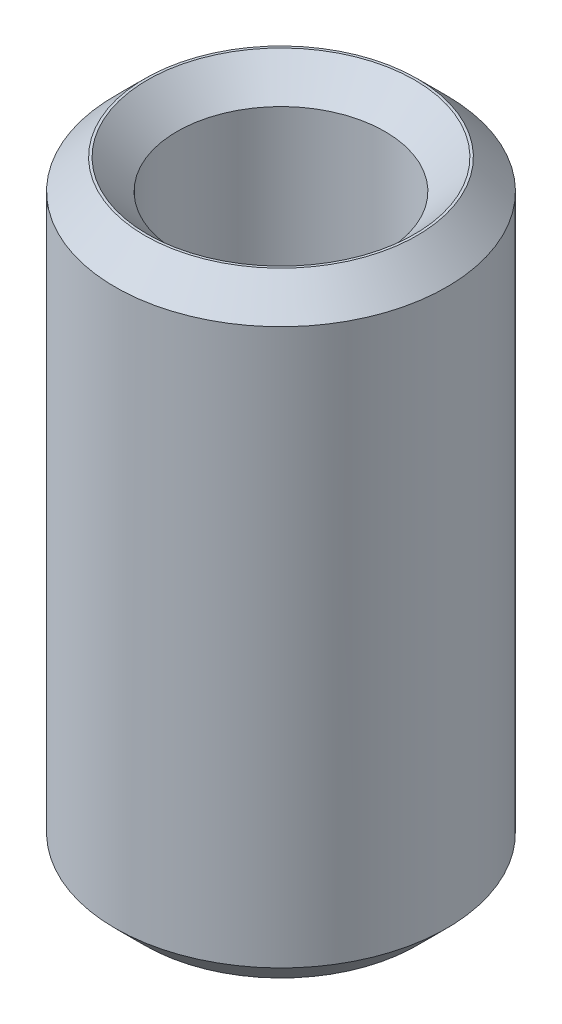
ISO-10303-21;
HEADER;
FILE_DESCRIPTION(('STEP AP214'),'2;1');
FILE_NAME('part.step','',(''),(''),'','','');
FILE_SCHEMA(('AUTOMOTIVE_DESIGN { 1 0 10303 214 1 1 1 1 }'));
ENDSEC;
DATA;
#1=APPLICATION_CONTEXT('core data for automotive mechanical design processes');
#2=APPLICATION_PROTOCOL_DEFINITION('international standard','automotive_design',2000,#1);
#3=PRODUCT_CONTEXT('',#1,'mechanical');
#4=PRODUCT('Part','Part','',(#3));
#5=PRODUCT_RELATED_PRODUCT_CATEGORY('part','',(#4));
#6=PRODUCT_DEFINITION_FORMATION('','',#4);
#7=PRODUCT_DEFINITION_CONTEXT('part definition',#1,'design');
#8=PRODUCT_DEFINITION('design','',#6,#7);
#9=PRODUCT_DEFINITION_SHAPE('','',#8);
#10=(LENGTH_UNIT() NAMED_UNIT(*) SI_UNIT(.MILLI.,.METRE.));
#11=(NAMED_UNIT(*) PLANE_ANGLE_UNIT() SI_UNIT($,.RADIAN.));
#12=(NAMED_UNIT(*) SI_UNIT($,.STERADIAN.) SOLID_ANGLE_UNIT());
#13=UNCERTAINTY_MEASURE_WITH_UNIT(LENGTH_MEASURE(1.E-05),#10,'distance_accuracy_value','');
#14=(GEOMETRIC_REPRESENTATION_CONTEXT(3) GLOBAL_UNCERTAINTY_ASSIGNED_CONTEXT((#13)) GLOBAL_UNIT_ASSIGNED_CONTEXT((#10,
#11,#12)) REPRESENTATION_CONTEXT('',''));
#15=CARTESIAN_POINT('',(0.,0.,0.));
#16=DIRECTION('',(0.,0.,1.));
#17=DIRECTION('',(1.,0.,0.));
#18=AXIS2_PLACEMENT_3D('',#15,#16,#17);
#19=CARTESIAN_POINT('',(0.,55.6229325444486,0.));
#20=DIRECTION('',(0.,-1.,0.));
#21=DIRECTION('',(0.,0.,-1.));
#22=AXIS2_PLACEMENT_3D('',#19,#20,#21);
#23=CYLINDRICAL_SURFACE('',#22,15.);
#24=CARTESIAN_POINT('',(0.,2.68824466655406,0.));
#25=DIRECTION('',(0.,1.,0.));
#26=DIRECTION('',(0.,0.,1.));
#27=AXIS2_PLACEMENT_3D('',#24,#25,#26);
#28=CIRCLE('',#27,15.);
#29=CARTESIAN_POINT('',(0.,2.68824466655405,-15.));
#30=VERTEX_POINT('',#29);
#31=EDGE_CURVE('E10',#30,#30,#28,.T.);
#32=CARTESIAN_POINT('',(0.,52.9346878778946,0.));
#33=DIRECTION('',(0.,1.,0.));
#34=DIRECTION('',(0.,0.,1.));
#35=AXIS2_PLACEMENT_3D('',#32,#33,#34);
#36=CIRCLE('',#35,15.);
#37=CARTESIAN_POINT('',(0.,52.9346878778946,-15.));
#38=VERTEX_POINT('',#37);
#39=EDGE_CURVE('E50',#38,#38,#36,.F.);
#40=CARTESIAN_POINT('',(0.,2.68824466655405,-15.));
#41=CARTESIAN_POINT('',(0.,3.21164511667218,-15.));
#42=CARTESIAN_POINT('',(0.,3.73504556679032,-15.));
#43=CARTESIAN_POINT('',(0.,4.78184646702658,-15.));
#44=CARTESIAN_POINT('',(0.,5.30524691714471,-15.));
#45=CARTESIAN_POINT('',(0.,6.35204781738097,-15.));
#46=CARTESIAN_POINT('',(0.,6.8754482674991,-15.));
#47=CARTESIAN_POINT('',(0.,7.92224916773536,-15.));
#48=CARTESIAN_POINT('',(0.,8.4456496178535,-15.));
#49=CARTESIAN_POINT('',(0.,9.49245051808976,-15.));
#50=CARTESIAN_POINT('',(0.,10.0158509682079,-15.));
#51=CARTESIAN_POINT('',(0.,11.0626518684441,-15.));
#52=CARTESIAN_POINT('',(0.,11.5860523185623,-15.));
#53=CARTESIAN_POINT('',(0.,12.6328532187985,-15.));
#54=CARTESIAN_POINT('',(0.,13.1562536689167,-15.));
#55=CARTESIAN_POINT('',(0.,14.2030545691529,-15.));
#56=CARTESIAN_POINT('',(0.,14.7264550192711,-15.));
#57=CARTESIAN_POINT('',(0.,15.7732559195073,-15.));
#58=CARTESIAN_POINT('',(0.,16.2966563696255,-15.));
#59=CARTESIAN_POINT('',(0.,17.3434572698617,-15.));
#60=CARTESIAN_POINT('',(0.,17.8668577199799,-15.));
#61=CARTESIAN_POINT('',(0.,18.9136586202161,-15.));
#62=CARTESIAN_POINT('',(0.,19.4370590703342,-15.));
#63=CARTESIAN_POINT('',(0.,20.4838599705705,-15.));
#64=CARTESIAN_POINT('',(0.,21.0072604206886,-15.));
#65=CARTESIAN_POINT('',(0.,22.0540613209249,-15.));
#66=CARTESIAN_POINT('',(0.,22.577461771043,-15.));
#67=CARTESIAN_POINT('',(0.,23.6242626712793,-15.));
#68=CARTESIAN_POINT('',(0.,24.1476631213974,-15.));
#69=CARTESIAN_POINT('',(0.,25.1944640216337,-15.));
#70=CARTESIAN_POINT('',(0.,25.7178644717518,-15.));
#71=CARTESIAN_POINT('',(0.,26.7646653719881,-15.));
#72=CARTESIAN_POINT('',(0.,27.2880658221062,-15.));
#73=CARTESIAN_POINT('',(0.,28.3348667223425,-15.));
#74=CARTESIAN_POINT('',(0.,28.8582671724606,-15.));
#75=CARTESIAN_POINT('',(0.,29.9050680726969,-15.));
#76=CARTESIAN_POINT('',(0.,30.428468522815,-15.));
#77=CARTESIAN_POINT('',(0.,31.4752694230513,-15.));
#78=CARTESIAN_POINT('',(0.,31.9986698731694,-15.));
#79=CARTESIAN_POINT('',(0.,33.0454707734056,-15.));
#80=CARTESIAN_POINT('',(0.,33.5688712235238,-15.));
#81=CARTESIAN_POINT('',(0.,34.61567212376,-15.));
#82=CARTESIAN_POINT('',(0.,35.1390725738782,-15.));
#83=CARTESIAN_POINT('',(0.,36.1858734741144,-15.));
#84=CARTESIAN_POINT('',(0.,36.7092739242326,-15.));
#85=CARTESIAN_POINT('',(0.,37.7560748244688,-15.));
#86=CARTESIAN_POINT('',(0.,38.279475274587,-15.));
#87=CARTESIAN_POINT('',(0.,39.3262761748232,-15.));
#88=CARTESIAN_POINT('',(0.,39.8496766249413,-15.));
#89=CARTESIAN_POINT('',(0.,40.8964775251776,-15.));
#90=CARTESIAN_POINT('',(0.,41.4198779752957,-15.));
#91=CARTESIAN_POINT('',(0.,42.466678875532,-15.));
#92=CARTESIAN_POINT('',(0.,42.9900793256501,-15.));
#93=CARTESIAN_POINT('',(0.,44.0368802258864,-15.));
#94=CARTESIAN_POINT('',(0.,44.5602806760045,-15.));
#95=CARTESIAN_POINT('',(0.,45.6070815762408,-15.));
#96=CARTESIAN_POINT('',(0.,46.1304820263589,-15.));
#97=CARTESIAN_POINT('',(0.,47.1772829265952,-15.));
#98=CARTESIAN_POINT('',(0.,47.7006833767133,-15.));
#99=CARTESIAN_POINT('',(0.,48.7474842769496,-15.));
#100=CARTESIAN_POINT('',(0.,49.2708847270677,-15.));
#101=CARTESIAN_POINT('',(0.,50.317685627304,-15.));
#102=CARTESIAN_POINT('',(0.,50.8410860774221,-15.));
#103=CARTESIAN_POINT('',(0.,51.8878869776584,-15.));
#104=CARTESIAN_POINT('',(0.,52.4112874277765,-15.));
#105=CARTESIAN_POINT('',(0.,52.9346878778946,-15.));
#106=B_SPLINE_CURVE_WITH_KNOTS('',3,(#40,#41,#42,#43,#44,#45,#46,#47,#48,#49,#50,#51,#52,#53,
#54,#55,#56,#57,#58,#59,#60,#61,#62,#63,#64,#65,#66,#67,#68,#69,#70,#71,#72,#73,#74,#75,#76,#77,
#78,#79,#80,#81,#82,#83,#84,#85,#86,#87,#88,#89,#90,#91,#92,#93,#94,#95,#96,#97,#98,#99,#100,
#101,#102,#103,#104,#105),.UNSPECIFIED.,.F.,.F.,(4,2,2,2,2,2,2,2,2,2,2,2,2,2,2,2,2,2,2,2,2,2,2,
2,2,2,2,2,2,2,2,2,4),(0.,1.57020135035439,3.14040270070878,4.71060405106318,6.28080540141757,
7.85100675177196,9.42120810212636,10.9914094524807,12.5616108028351,14.1318121531895,
15.7020135035439,17.2722148538983,18.8424162042527,20.4126175546071,21.9828189049615,
23.5530202553159,25.1232216056703,26.6934229560247,28.2636243063791,29.8338256567335,
31.4040270070879,32.9742283574423,34.5444297077966,36.114631058151,37.6848324085054,
39.2550337588598,40.8252351092142,42.3954364595686,43.965637809923,45.5358391602774,
47.1060405106318,48.6762418609862,50.2464432113406),.UNSPECIFIED.);
#107=EDGE_CURVE('BSEAM39',#30,#38,#106,.T.);
#108=ORIENTED_EDGE('',*,*,#31,.T.);
#109=ORIENTED_EDGE('',*,*,#39,.T.);
#110=ORIENTED_EDGE('',*,*,#107,.T.);
#111=ORIENTED_EDGE('',*,*,#107,.F.);
#112=EDGE_LOOP('',(#108,#110,#109,#111));
#113=FACE_BOUND('',#112,.T.);
#114=ADVANCED_FACE('F39',(#113),#23,.T.);
#115=CARTESIAN_POINT('',(0.,55.6229325444486,0.));
#116=DIRECTION('',(0.,1.,0.));
#117=DIRECTION('',(0.,0.,1.));
#118=AXIS2_PLACEMENT_3D('',#115,#116,#117);
#119=PLANE('',#118);
#120=CARTESIAN_POINT('',(0.,55.6229325444486,0.));
#121=DIRECTION('',(0.,1.,0.));
#122=DIRECTION('',(0.,0.,1.));
#123=AXIS2_PLACEMENT_3D('',#120,#121,#122);
#124=CIRCLE('',#123,12.0900191837989);
#125=CARTESIAN_POINT('',(0.,55.6229325444486,12.0900191837989));
#126=VERTEX_POINT('',#125);
#127=EDGE_CURVE('E58',#126,#126,#124,.F.);
#128=ORIENTED_EDGE('',*,*,#127,.T.);
#129=EDGE_LOOP('',(#128));
#130=FACE_BOUND('',#129,.T.);
#131=CARTESIAN_POINT('',(0.,55.6229325444486,0.));
#132=DIRECTION('',(0.,1.,0.));
#133=DIRECTION('',(0.,0.,1.));
#134=AXIS2_PLACEMENT_3D('',#131,#132,#133);
#135=CIRCLE('',#134,12.311755333446);
#136=CARTESIAN_POINT('',(0.,55.6229325444486,12.311755333446));
#137=VERTEX_POINT('',#136);
#138=EDGE_CURVE('E61',#137,#137,#135,.T.);
#139=ORIENTED_EDGE('',*,*,#138,.T.);
#140=EDGE_LOOP('',(#139));
#141=FACE_BOUND('',#140,.T.);
#142=ADVANCED_FACE('F88',(#130,#141),#119,.T.);
#143=CARTESIAN_POINT('',(0.,0.,0.));
#144=DIRECTION('',(0.,1.,0.));
#145=DIRECTION('',(0.,0.,1.));
#146=AXIS2_PLACEMENT_3D('',#143,#144,#145);
#147=PLANE('',#146);
#148=CARTESIAN_POINT('',(0.,0.,0.));
#149=DIRECTION('',(0.,1.,0.));
#150=DIRECTION('',(0.,0.,1.));
#151=AXIS2_PLACEMENT_3D('',#148,#149,#150);
#152=CIRCLE('',#151,12.0900191837988);
#153=CARTESIAN_POINT('',(0.,0.,12.0900191837988));
#154=VERTEX_POINT('',#153);
#155=EDGE_CURVE('E51',#154,#154,#152,.T.);
#156=ORIENTED_EDGE('',*,*,#155,.T.);
#157=EDGE_LOOP('',(#156));
#158=FACE_BOUND('',#157,.T.);
#159=CARTESIAN_POINT('',(0.,0.,0.));
#160=DIRECTION('',(0.,1.,0.));
#161=DIRECTION('',(0.,0.,1.));
#162=AXIS2_PLACEMENT_3D('',#159,#160,#161);
#163=CIRCLE('',#162,12.3117553334459);
#164=CARTESIAN_POINT('',(0.,0.,12.3117553334459));
#165=VERTEX_POINT('',#164);
#166=EDGE_CURVE('E54',#165,#165,#163,.F.);
#167=ORIENTED_EDGE('',*,*,#166,.T.);
#168=EDGE_LOOP('',(#167));
#169=FACE_BOUND('',#168,.T.);
#170=ADVANCED_FACE('F83',(#158,#169),#147,.F.);
#171=CARTESIAN_POINT('',(0.,55.6229325444486,0.));
#172=DIRECTION('',(0.,-1.,0.));
#173=DIRECTION('',(0.,0.,-1.));
#174=AXIS2_PLACEMENT_3D('',#171,#172,#173);
#175=CYLINDRICAL_SURFACE('',#174,9.40177451724484);
#176=CARTESIAN_POINT('',(0.,52.9346878778946,0.));
#177=DIRECTION('',(0.,1.,0.));
#178=DIRECTION('',(0.,0.,1.));
#179=AXIS2_PLACEMENT_3D('',#176,#177,#178);
#180=CIRCLE('',#179,9.40177451724484);
#181=CARTESIAN_POINT('',(0.,52.9346878778946,-9.40177451724484));
#182=VERTEX_POINT('',#181);
#183=EDGE_CURVE('E67',#182,#182,#180,.T.);
#184=CARTESIAN_POINT('',(0.,2.68824466655403,0.));
#185=DIRECTION('',(0.,1.,0.));
#186=DIRECTION('',(0.,0.,1.));
#187=AXIS2_PLACEMENT_3D('',#184,#185,#186);
#188=CIRCLE('',#187,9.40177451724484);
#189=CARTESIAN_POINT('',(0.,2.68824466655403,-9.40177451724484));
#190=VERTEX_POINT('',#189);
#191=EDGE_CURVE('E69',#190,#190,#188,.F.);
#192=CARTESIAN_POINT('',(0.,52.9346878778946,-9.40177451724484));
#193=CARTESIAN_POINT('',(0.,52.4112874277765,-9.40177451724484));
#194=CARTESIAN_POINT('',(0.,51.8878869776583,-9.40177451724484));
#195=CARTESIAN_POINT('',(0.,50.8410860774221,-9.40177451724484));
#196=CARTESIAN_POINT('',(0.,50.3176856273039,-9.40177451724484));
#197=CARTESIAN_POINT('',(0.,49.2708847270677,-9.40177451724484));
#198=CARTESIAN_POINT('',(0.,48.7474842769495,-9.40177451724484));
#199=CARTESIAN_POINT('',(0.,47.7006833767133,-9.40177451724484));
#200=CARTESIAN_POINT('',(0.,47.1772829265951,-9.40177451724484));
#201=CARTESIAN_POINT('',(0.,46.1304820263589,-9.40177451724484));
#202=CARTESIAN_POINT('',(0.,45.6070815762408,-9.40177451724484));
#203=CARTESIAN_POINT('',(0.,44.5602806760045,-9.40177451724484));
#204=CARTESIAN_POINT('',(0.,44.0368802258864,-9.40177451724484));
#205=CARTESIAN_POINT('',(0.,42.9900793256501,-9.40177451724484));
#206=CARTESIAN_POINT('',(0.,42.466678875532,-9.40177451724484));
#207=CARTESIAN_POINT('',(0.,41.4198779752957,-9.40177451724484));
#208=CARTESIAN_POINT('',(0.,40.8964775251776,-9.40177451724484));
#209=CARTESIAN_POINT('',(0.,39.8496766249413,-9.40177451724484));
#210=CARTESIAN_POINT('',(0.,39.3262761748232,-9.40177451724484));
#211=CARTESIAN_POINT('',(0.,38.2794752745869,-9.40177451724484));
#212=CARTESIAN_POINT('',(0.,37.7560748244688,-9.40177451724484));
#213=CARTESIAN_POINT('',(0.,36.7092739242325,-9.40177451724484));
#214=CARTESIAN_POINT('',(0.,36.1858734741144,-9.40177451724484));
#215=CARTESIAN_POINT('',(0.,35.1390725738781,-9.40177451724484));
#216=CARTESIAN_POINT('',(0.,34.61567212376,-9.40177451724484));
#217=CARTESIAN_POINT('',(0.,33.5688712235238,-9.40177451724484));
#218=CARTESIAN_POINT('',(0.,33.0454707734056,-9.40177451724484));
#219=CARTESIAN_POINT('',(0.,31.9986698731693,-9.40177451724484));
#220=CARTESIAN_POINT('',(0.,31.4752694230512,-9.40177451724484));
#221=CARTESIAN_POINT('',(0.,30.428468522815,-9.40177451724484));
#222=CARTESIAN_POINT('',(0.,29.9050680726968,-9.40177451724484));
#223=CARTESIAN_POINT('',(0.,28.8582671724606,-9.40177451724484));
#224=CARTESIAN_POINT('',(0.,28.3348667223424,-9.40177451724484));
#225=CARTESIAN_POINT('',(0.,27.2880658221062,-9.40177451724484));
#226=CARTESIAN_POINT('',(0.,26.764665371988,-9.40177451724484));
#227=CARTESIAN_POINT('',(0.,25.7178644717518,-9.40177451724484));
#228=CARTESIAN_POINT('',(0.,25.1944640216336,-9.40177451724484));
#229=CARTESIAN_POINT('',(0.,24.1476631213974,-9.40177451724484));
#230=CARTESIAN_POINT('',(0.,23.6242626712793,-9.40177451724484));
#231=CARTESIAN_POINT('',(0.,22.577461771043,-9.40177451724484));
#232=CARTESIAN_POINT('',(0.,22.0540613209249,-9.40177451724484));
#233=CARTESIAN_POINT('',(0.,21.0072604206886,-9.40177451724484));
#234=CARTESIAN_POINT('',(0.,20.4838599705705,-9.40177451724484));
#235=CARTESIAN_POINT('',(0.,19.4370590703342,-9.40177451724484));
#236=CARTESIAN_POINT('',(0.,18.9136586202161,-9.40177451724484));
#237=CARTESIAN_POINT('',(0.,17.8668577199798,-9.40177451724484));
#238=CARTESIAN_POINT('',(0.,17.3434572698617,-9.40177451724484));
#239=CARTESIAN_POINT('',(0.,16.2966563696254,-9.40177451724484));
#240=CARTESIAN_POINT('',(0.,15.7732559195073,-9.40177451724484));
#241=CARTESIAN_POINT('',(0.,14.726455019271,-9.40177451724484));
#242=CARTESIAN_POINT('',(0.,14.2030545691529,-9.40177451724484));
#243=CARTESIAN_POINT('',(0.,13.1562536689166,-9.40177451724484));
#244=CARTESIAN_POINT('',(0.,12.6328532187985,-9.40177451724484));
#245=CARTESIAN_POINT('',(0.,11.5860523185622,-9.40177451724484));
#246=CARTESIAN_POINT('',(0.,11.0626518684441,-9.40177451724484));
#247=CARTESIAN_POINT('',(0.,10.0158509682079,-9.40177451724484));
#248=CARTESIAN_POINT('',(0.,9.49245051808972,-9.40177451724484));
#249=CARTESIAN_POINT('',(0.,8.44564961785346,-9.40177451724484));
#250=CARTESIAN_POINT('',(0.,7.92224916773533,-9.40177451724484));
#251=CARTESIAN_POINT('',(0.,6.87544826749907,-9.40177451724484));
#252=CARTESIAN_POINT('',(0.,6.35204781738094,-9.40177451724484));
#253=CARTESIAN_POINT('',(0.,5.30524691714468,-9.40177451724484));
#254=CARTESIAN_POINT('',(0.,4.78184646702655,-9.40177451724484));
#255=CARTESIAN_POINT('',(0.,3.73504556679029,-9.40177451724484));
#256=CARTESIAN_POINT('',(0.,3.21164511667216,-9.40177451724484));
#257=CARTESIAN_POINT('',(0.,2.68824466655403,-9.40177451724484));
#258=B_SPLINE_CURVE_WITH_KNOTS('',3,(#192,#193,#194,#195,#196,#197,#198,#199,#200,#201,#202,
#203,#204,#205,#206,#207,#208,#209,#210,#211,#212,#213,#214,#215,#216,#217,#218,#219,#220,#221,
#222,#223,#224,#225,#226,#227,#228,#229,#230,#231,#232,#233,#234,#235,#236,#237,#238,#239,#240,
#241,#242,#243,#244,#245,#246,#247,#248,#249,#250,#251,#252,#253,#254,#255,#256,#257),
.UNSPECIFIED.,.F.,.F.,(4,2,2,2,2,2,2,2,2,2,2,2,2,2,2,2,2,2,2,2,2,2,2,2,2,2,2,2,2,2,2,2,4),(0.,
1.5702013503544,3.14040270070879,4.71060405106318,6.28080540141757,7.85100675177196,
9.42120810212636,10.9914094524807,12.5616108028351,14.1318121531895,15.7020135035439,
17.2722148538983,18.8424162042527,20.4126175546071,21.9828189049615,23.5530202553159,
25.1232216056703,26.6934229560247,28.2636243063791,29.8338256567335,31.4040270070879,
32.9742283574422,34.5444297077966,36.114631058151,37.6848324085054,39.2550337588598,
40.8252351092142,42.3954364595686,43.965637809923,45.5358391602774,47.1060405106318,
48.6762418609862,50.2464432113406),.UNSPECIFIED.);
#259=EDGE_CURVE('BSEAM71',#182,#190,#258,.T.);
#260=ORIENTED_EDGE('',*,*,#183,.T.);
#261=ORIENTED_EDGE('',*,*,#191,.T.);
#262=ORIENTED_EDGE('',*,*,#259,.T.);
#263=ORIENTED_EDGE('',*,*,#259,.F.);
#264=EDGE_LOOP('',(#260,#262,#261,#263));
#265=FACE_BOUND('',#264,.T.);
#266=ADVANCED_FACE('F71',(#265),#175,.F.);
#267=CARTESIAN_POINT('',(0.,52.9346878778946,0.));
#268=DIRECTION('',(0.,1.,0.));
#269=DIRECTION('',(0.,0.,1.));
#270=AXIS2_PLACEMENT_3D('',#267,#268,#269);
#271=CONICAL_SURFACE('',#270,9.40177451724484,0.785398163397451);
#272=ORIENTED_EDGE('',*,*,#127,.F.);
#273=EDGE_LOOP('',(#272));
#274=FACE_BOUND('',#273,.T.);
#275=ORIENTED_EDGE('',*,*,#183,.F.);
#276=EDGE_LOOP('',(#275));
#277=FACE_BOUND('',#276,.T.);
#278=ADVANCED_FACE('F77',(#274,#277),#271,.F.);
#279=CARTESIAN_POINT('',(0.,0.,0.));
#280=DIRECTION('',(0.,-1.,0.));
#281=DIRECTION('',(0.,0.,-1.));
#282=AXIS2_PLACEMENT_3D('',#279,#280,#281);
#283=CONICAL_SURFACE('',#282,12.0900191837988,0.785398163397442);
#284=ORIENTED_EDGE('',*,*,#191,.F.);
#285=EDGE_LOOP('',(#284));
#286=FACE_BOUND('',#285,.T.);
#287=ORIENTED_EDGE('',*,*,#155,.F.);
#288=EDGE_LOOP('',(#287));
#289=FACE_BOUND('',#288,.T.);
#290=ADVANCED_FACE('F73',(#286,#289),#283,.F.);
#291=CARTESIAN_POINT('',(0.,2.68824466655406,0.));
#292=DIRECTION('',(0.,1.,0.));
#293=DIRECTION('',(0.,0.,1.));
#294=AXIS2_PLACEMENT_3D('',#291,#292,#293);
#295=CONICAL_SURFACE('',#294,15.,0.785398163397453);
#296=ORIENTED_EDGE('',*,*,#166,.F.);
#297=EDGE_LOOP('',(#296));
#298=FACE_BOUND('',#297,.T.);
#299=ORIENTED_EDGE('',*,*,#31,.F.);
#300=EDGE_LOOP('',(#299));
#301=FACE_BOUND('',#300,.T.);
#302=ADVANCED_FACE('F76',(#298,#301),#295,.T.);
#303=CARTESIAN_POINT('',(0.,55.6229325444486,0.));
#304=DIRECTION('',(0.,-1.,0.));
#305=DIRECTION('',(0.,0.,-1.));
#306=AXIS2_PLACEMENT_3D('',#303,#304,#305);
#307=CONICAL_SURFACE('',#306,12.311755333446,0.785398163397446);
#308=ORIENTED_EDGE('',*,*,#39,.F.);
#309=EDGE_LOOP('',(#308));
#310=FACE_BOUND('',#309,.T.);
#311=ORIENTED_EDGE('',*,*,#138,.F.);
#312=EDGE_LOOP('',(#311));
#313=FACE_BOUND('',#312,.T.);
#314=ADVANCED_FACE('F45',(#310,#313),#307,.T.);
#315=CLOSED_SHELL('',(#114,#142,#170,#266,#278,#290,#302,#314));
#316=MANIFOLD_SOLID_BREP('B2',#315);
#317=ADVANCED_BREP_SHAPE_REPRESENTATION('',(#18,#316),#14);
#318=SHAPE_DEFINITION_REPRESENTATION(#9,#317);
ENDSEC;
END-ISO-10303-21;
